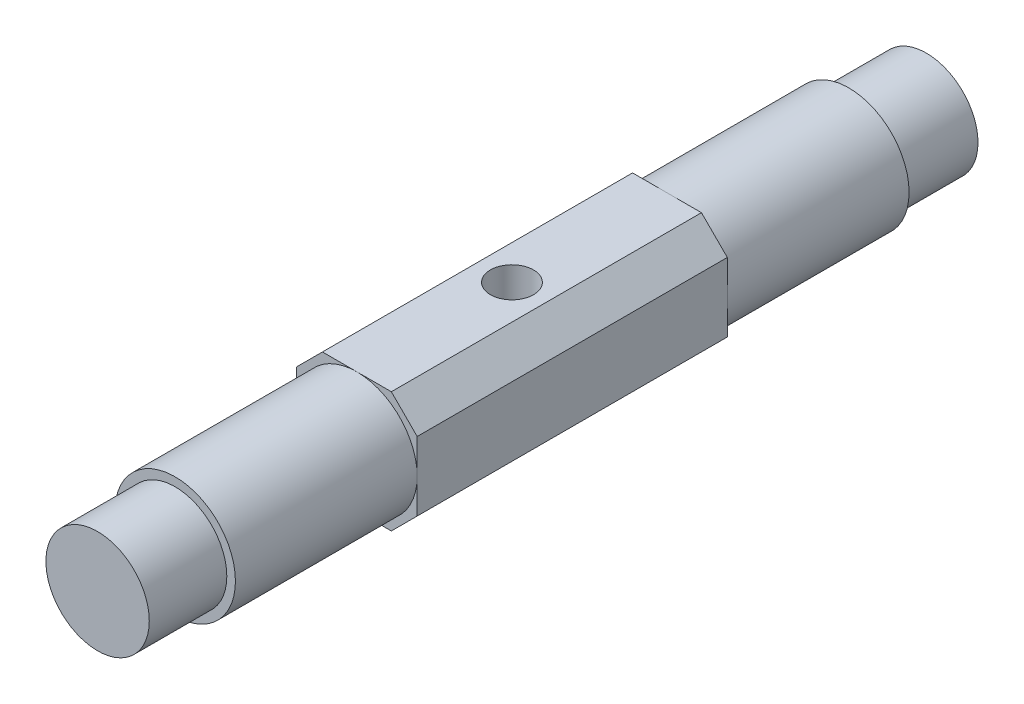
ISO-10303-21;
HEADER;
FILE_DESCRIPTION(('STEP AP214'),'2;1');
FILE_NAME('part.step','',(''),(''),'','','');
FILE_SCHEMA(('AUTOMOTIVE_DESIGN { 1 0 10303 214 1 1 1 1 }'));
ENDSEC;
DATA;
#1=APPLICATION_CONTEXT('core data for automotive mechanical design processes');
#2=APPLICATION_PROTOCOL_DEFINITION('international standard','automotive_design',2000,#1);
#3=PRODUCT_CONTEXT('',#1,'mechanical');
#4=PRODUCT('Part','Part','',(#3));
#5=PRODUCT_RELATED_PRODUCT_CATEGORY('part','',(#4));
#6=PRODUCT_DEFINITION_FORMATION('','',#4);
#7=PRODUCT_DEFINITION_CONTEXT('part definition',#1,'design');
#8=PRODUCT_DEFINITION('design','',#6,#7);
#9=PRODUCT_DEFINITION_SHAPE('','',#8);
#10=(LENGTH_UNIT() NAMED_UNIT(*) SI_UNIT(.MILLI.,.METRE.));
#11=(NAMED_UNIT(*) PLANE_ANGLE_UNIT() SI_UNIT($,.RADIAN.));
#12=(NAMED_UNIT(*) SI_UNIT($,.STERADIAN.) SOLID_ANGLE_UNIT());
#13=UNCERTAINTY_MEASURE_WITH_UNIT(LENGTH_MEASURE(1.E-05),#10,'distance_accuracy_value','');
#14=(GEOMETRIC_REPRESENTATION_CONTEXT(3) GLOBAL_UNCERTAINTY_ASSIGNED_CONTEXT((#13)) GLOBAL_UNIT_ASSIGNED_CONTEXT((#10,
#11,#12)) REPRESENTATION_CONTEXT('',''));
#15=CARTESIAN_POINT('',(0.,0.,0.));
#16=DIRECTION('',(0.,0.,1.));
#17=DIRECTION('',(1.,0.,0.));
#18=AXIS2_PLACEMENT_3D('',#15,#16,#17);
#19=CARTESIAN_POINT('',(0.,0.,33.05));
#20=DIRECTION('',(0.,0.,1.));
#21=DIRECTION('',(1.,0.,0.));
#22=AXIS2_PLACEMENT_3D('',#19,#20,#21);
#23=PLANE('',#22);
#24=DIRECTION('',(0.,1.,0.));
#25=VECTOR('',#24,1.);
#26=CARTESIAN_POINT('',(3.5,-3.5,33.05));
#27=LINE('',#26,#25);
#28=CARTESIAN_POINT('',(3.5,0.,33.05));
#29=VERTEX_POINT('',#28);
#30=CARTESIAN_POINT('',(3.5,1.99999999999999,33.05));
#31=VERTEX_POINT('',#30);
#32=EDGE_CURVE('E137',#29,#31,#27,.T.);
#33=ORIENTED_EDGE('',*,*,#32,.T.);
#34=DIRECTION('',(0.707106781186546,-0.707106781186549,0.));
#35=VECTOR('',#34,1.);
#36=CARTESIAN_POINT('',(2.75,2.74999999999999,33.05));
#37=LINE('',#36,#35);
#38=CARTESIAN_POINT('',(2.,3.5,33.05));
#39=VERTEX_POINT('',#38);
#40=EDGE_CURVE('E216',#31,#39,#37,.F.);
#41=ORIENTED_EDGE('',*,*,#40,.T.);
#42=DIRECTION('',(-1.,0.,0.));
#43=VECTOR('',#42,1.);
#44=CARTESIAN_POINT('',(3.5,3.5,33.05));
#45=LINE('',#44,#43);
#46=CARTESIAN_POINT('',(0.,3.5,33.05));
#47=VERTEX_POINT('',#46);
#48=EDGE_CURVE('E151',#39,#47,#45,.T.);
#49=ORIENTED_EDGE('',*,*,#48,.T.);
#50=CARTESIAN_POINT('',(0.,0.,33.05));
#51=DIRECTION('',(0.,0.,1.));
#52=DIRECTION('',(1.,0.,0.));
#53=AXIS2_PLACEMENT_3D('',#50,#51,#52);
#54=CIRCLE('',#53,3.5);
#55=EDGE_CURVE('E149',#29,#47,#54,.T.);
#56=ORIENTED_EDGE('',*,*,#55,.F.);
#57=EDGE_LOOP('',(#33,#41,#49,#56));
#58=FACE_BOUND('',#57,.T.);
#59=ADVANCED_FACE('F35',(#58),#23,.T.);
#60=CARTESIAN_POINT('',(-2.,3.5,33.05));
#61=VERTEX_POINT('',#60);
#62=EDGE_CURVE('E136',#47,#61,#45,.T.);
#63=ORIENTED_EDGE('',*,*,#62,.T.);
#64=DIRECTION('',(-0.707106781186549,-0.707106781186546,0.));
#65=VECTOR('',#64,1.);
#66=CARTESIAN_POINT('',(-2.74999999999999,2.75000000000001,33.05));
#67=LINE('',#66,#65);
#68=CARTESIAN_POINT('',(-3.5,2.,33.05));
#69=VERTEX_POINT('',#68);
#70=EDGE_CURVE('E11',#61,#69,#67,.T.);
#71=ORIENTED_EDGE('',*,*,#70,.T.);
#72=DIRECTION('',(0.,1.,0.));
#73=VECTOR('',#72,1.);
#74=CARTESIAN_POINT('',(-3.5,-3.5,33.05));
#75=LINE('',#74,#73);
#76=CARTESIAN_POINT('',(-3.5,0.,33.05));
#77=VERTEX_POINT('',#76);
#78=EDGE_CURVE('E171',#77,#69,#75,.T.);
#79=ORIENTED_EDGE('',*,*,#78,.F.);
#80=EDGE_CURVE('E158',#47,#77,#54,.T.);
#81=ORIENTED_EDGE('',*,*,#80,.F.);
#82=EDGE_LOOP('',(#63,#71,#79,#81));
#83=FACE_BOUND('',#82,.T.);
#84=ADVANCED_FACE('F241',(#83),#23,.T.);
#85=CARTESIAN_POINT('',(-3.5,-2.00000000000001,33.05));
#86=VERTEX_POINT('',#85);
#87=EDGE_CURVE('E172',#86,#77,#75,.T.);
#88=ORIENTED_EDGE('',*,*,#87,.F.);
#89=DIRECTION('',(-0.707106781186548,0.707106781186548,0.));
#90=VECTOR('',#89,1.);
#91=CARTESIAN_POINT('',(-2.75,-2.75,33.05));
#92=LINE('',#91,#90);
#93=CARTESIAN_POINT('',(-2.,-3.5,33.05));
#94=VERTEX_POINT('',#93);
#95=EDGE_CURVE('E224',#86,#94,#92,.F.);
#96=ORIENTED_EDGE('',*,*,#95,.T.);
#97=DIRECTION('',(-1.,0.,0.));
#98=VECTOR('',#97,1.);
#99=CARTESIAN_POINT('',(3.5,-3.5,33.05));
#100=LINE('',#99,#98);
#101=CARTESIAN_POINT('',(0.,-3.5,33.05));
#102=VERTEX_POINT('',#101);
#103=EDGE_CURVE('E174',#102,#94,#100,.T.);
#104=ORIENTED_EDGE('',*,*,#103,.F.);
#105=EDGE_CURVE('E162',#77,#102,#54,.T.);
#106=ORIENTED_EDGE('',*,*,#105,.F.);
#107=EDGE_LOOP('',(#88,#96,#104,#106));
#108=FACE_BOUND('',#107,.T.);
#109=ADVANCED_FACE('F266',(#108),#23,.T.);
#110=CARTESIAN_POINT('',(0.,0.,4.5));
#111=DIRECTION('',(0.,0.,-1.));
#112=DIRECTION('',(-1.,0.,0.));
#113=AXIS2_PLACEMENT_3D('',#110,#111,#112);
#114=CYLINDRICAL_SURFACE('',#113,3.);
#115=CARTESIAN_POINT('',(0.,0.,4.5));
#116=DIRECTION('',(0.,0.,1.));
#117=DIRECTION('',(1.,0.,0.));
#118=AXIS2_PLACEMENT_3D('',#115,#116,#117);
#119=CIRCLE('',#118,3.);
#120=CARTESIAN_POINT('',(3.,0.,4.5));
#121=VERTEX_POINT('',#120);
#122=EDGE_CURVE('E163',#121,#121,#119,.T.);
#123=ORIENTED_EDGE('',*,*,#122,.F.);
#124=EDGE_LOOP('',(#123));
#125=FACE_BOUND('',#124,.T.);
#126=CARTESIAN_POINT('',(0.,0.,0.));
#127=DIRECTION('',(0.,0.,1.));
#128=DIRECTION('',(1.,0.,0.));
#129=AXIS2_PLACEMENT_3D('',#126,#127,#128);
#130=CIRCLE('',#129,3.);
#131=CARTESIAN_POINT('',(3.,0.,0.));
#132=VERTEX_POINT('',#131);
#133=EDGE_CURVE('E165',#132,#132,#130,.T.);
#134=ORIENTED_EDGE('',*,*,#133,.T.);
#135=EDGE_LOOP('',(#134));
#136=FACE_BOUND('',#135,.T.);
#137=ADVANCED_FACE('F296',(#125,#136),#114,.T.);
#138=CARTESIAN_POINT('',(0.,0.,0.));
#139=DIRECTION('',(0.,0.,1.));
#140=DIRECTION('',(1.,0.,0.));
#141=AXIS2_PLACEMENT_3D('',#138,#139,#140);
#142=PLANE('',#141);
#143=ORIENTED_EDGE('',*,*,#133,.F.);
#144=EDGE_LOOP('',(#143));
#145=FACE_BOUND('',#144,.T.);
#146=ADVANCED_FACE('F292',(#145),#142,.F.);
#147=CARTESIAN_POINT('',(0.,0.,15.05));
#148=DIRECTION('',(0.,0.,-1.));
#149=DIRECTION('',(-1.,0.,0.));
#150=AXIS2_PLACEMENT_3D('',#147,#148,#149);
#151=CYLINDRICAL_SURFACE('',#150,3.5);
#152=CARTESIAN_POINT('',(0.,0.,15.05));
#153=DIRECTION('',(0.,0.,1.));
#154=DIRECTION('',(1.,0.,0.));
#155=AXIS2_PLACEMENT_3D('',#152,#153,#154);
#156=CIRCLE('',#155,3.5);
#157=CARTESIAN_POINT('',(3.5,0.,15.05));
#158=VERTEX_POINT('',#157);
#159=CARTESIAN_POINT('',(0.,3.5,15.05));
#160=VERTEX_POINT('',#159);
#161=EDGE_CURVE('E189',#158,#160,#156,.T.);
#162=ORIENTED_EDGE('',*,*,#161,.F.);
#163=CARTESIAN_POINT('',(0.,-3.5,15.05));
#164=VERTEX_POINT('',#163);
#165=EDGE_CURVE('E193',#164,#158,#156,.T.);
#166=ORIENTED_EDGE('',*,*,#165,.F.);
#167=CARTESIAN_POINT('',(-3.5,0.,15.05));
#168=VERTEX_POINT('',#167);
#169=EDGE_CURVE('E328',#168,#164,#156,.T.);
#170=ORIENTED_EDGE('',*,*,#169,.F.);
#171=EDGE_CURVE('E192',#160,#168,#156,.T.);
#172=ORIENTED_EDGE('',*,*,#171,.F.);
#173=EDGE_LOOP('',(#162,#166,#170,#172));
#174=FACE_BOUND('',#173,.T.);
#175=CARTESIAN_POINT('',(0.,0.,4.5));
#176=DIRECTION('',(0.,0.,1.));
#177=DIRECTION('',(1.,0.,0.));
#178=AXIS2_PLACEMENT_3D('',#175,#176,#177);
#179=CIRCLE('',#178,3.5);
#180=CARTESIAN_POINT('',(3.5,0.,4.5));
#181=VERTEX_POINT('',#180);
#182=EDGE_CURVE('E177',#181,#181,#179,.T.);
#183=ORIENTED_EDGE('',*,*,#182,.T.);
#184=EDGE_LOOP('',(#183));
#185=FACE_BOUND('',#184,.T.);
#186=ADVANCED_FACE('F288',(#174,#185),#151,.T.);
#187=CARTESIAN_POINT('',(0.,0.,4.5));
#188=DIRECTION('',(0.,0.,1.));
#189=DIRECTION('',(1.,0.,0.));
#190=AXIS2_PLACEMENT_3D('',#187,#188,#189);
#191=PLANE('',#190);
#192=ORIENTED_EDGE('',*,*,#122,.T.);
#193=EDGE_LOOP('',(#192));
#194=FACE_BOUND('',#193,.T.);
#195=ORIENTED_EDGE('',*,*,#182,.F.);
#196=EDGE_LOOP('',(#195));
#197=FACE_BOUND('',#196,.T.);
#198=ADVANCED_FACE('F274',(#194,#197),#191,.F.);
#199=CARTESIAN_POINT('',(0.,0.,15.05));
#200=DIRECTION('',(0.,0.,1.));
#201=DIRECTION('',(1.,0.,0.));
#202=AXIS2_PLACEMENT_3D('',#199,#200,#201);
#203=PLANE('',#202);
#204=DIRECTION('',(-1.,0.,0.));
#205=VECTOR('',#204,1.);
#206=CARTESIAN_POINT('',(3.5,3.5,15.05));
#207=LINE('',#206,#205);
#208=CARTESIAN_POINT('',(2.,3.5,15.05));
#209=VERTEX_POINT('',#208);
#210=EDGE_CURVE('E182',#209,#160,#207,.T.);
#211=ORIENTED_EDGE('',*,*,#210,.F.);
#212=DIRECTION('',(-0.707106781186546,0.707106781186549,0.));
#213=VECTOR('',#212,1.);
#214=CARTESIAN_POINT('',(2.,3.5,15.05));
#215=LINE('',#214,#213);
#216=CARTESIAN_POINT('',(3.5,1.99999999999999,15.05));
#217=VERTEX_POINT('',#216);
#218=EDGE_CURVE('E214',#209,#217,#215,.F.);
#219=ORIENTED_EDGE('',*,*,#218,.T.);
#220=DIRECTION('',(0.,1.,0.));
#221=VECTOR('',#220,1.);
#222=CARTESIAN_POINT('',(3.5,-3.5,15.05));
#223=LINE('',#222,#221);
#224=EDGE_CURVE('E181',#158,#217,#223,.T.);
#225=ORIENTED_EDGE('',*,*,#224,.F.);
#226=ORIENTED_EDGE('',*,*,#161,.T.);
#227=EDGE_LOOP('',(#211,#219,#225,#226));
#228=FACE_BOUND('',#227,.T.);
#229=ADVANCED_FACE('F247',(#228),#203,.F.);
#230=DIRECTION('',(0.,1.,0.));
#231=VECTOR('',#230,1.);
#232=CARTESIAN_POINT('',(-3.5,-3.5,15.05));
#233=LINE('',#232,#231);
#234=CARTESIAN_POINT('',(-3.5,2.,15.05));
#235=VERTEX_POINT('',#234);
#236=EDGE_CURVE('E184',#168,#235,#233,.T.);
#237=ORIENTED_EDGE('',*,*,#236,.T.);
#238=DIRECTION('',(0.707106781186549,0.707106781186546,0.));
#239=VECTOR('',#238,1.);
#240=CARTESIAN_POINT('',(-3.5,2.00000000000001,15.05));
#241=LINE('',#240,#239);
#242=CARTESIAN_POINT('',(-2.,3.5,15.05));
#243=VERTEX_POINT('',#242);
#244=EDGE_CURVE('E43',#235,#243,#241,.T.);
#245=ORIENTED_EDGE('',*,*,#244,.T.);
#246=EDGE_CURVE('E180',#160,#243,#207,.T.);
#247=ORIENTED_EDGE('',*,*,#246,.F.);
#248=ORIENTED_EDGE('',*,*,#171,.T.);
#249=EDGE_LOOP('',(#237,#245,#247,#248));
#250=FACE_BOUND('',#249,.T.);
#251=ADVANCED_FACE('F229',(#250),#203,.F.);
#252=DIRECTION('',(-1.,0.,0.));
#253=VECTOR('',#252,1.);
#254=CARTESIAN_POINT('',(3.5,-3.5,15.05));
#255=LINE('',#254,#253);
#256=CARTESIAN_POINT('',(-2.,-3.5,15.05));
#257=VERTEX_POINT('',#256);
#258=EDGE_CURVE('E187',#164,#257,#255,.T.);
#259=ORIENTED_EDGE('',*,*,#258,.T.);
#260=DIRECTION('',(0.707106781186548,-0.707106781186548,0.));
#261=VECTOR('',#260,1.);
#262=CARTESIAN_POINT('',(-2.,-3.5,15.05));
#263=LINE('',#262,#261);
#264=CARTESIAN_POINT('',(-3.5,-2.00000000000001,15.05));
#265=VERTEX_POINT('',#264);
#266=EDGE_CURVE('E218',#257,#265,#263,.F.);
#267=ORIENTED_EDGE('',*,*,#266,.T.);
#268=EDGE_CURVE('E185',#265,#168,#233,.T.);
#269=ORIENTED_EDGE('',*,*,#268,.T.);
#270=ORIENTED_EDGE('',*,*,#169,.T.);
#271=EDGE_LOOP('',(#259,#267,#269,#270));
#272=FACE_BOUND('',#271,.T.);
#273=ADVANCED_FACE('F333',(#272),#203,.F.);
#274=CARTESIAN_POINT('',(3.5,-2.,15.05));
#275=VERTEX_POINT('',#274);
#276=EDGE_CURVE('E178',#275,#158,#223,.T.);
#277=ORIENTED_EDGE('',*,*,#276,.F.);
#278=DIRECTION('',(-0.707106781186549,-0.707106781186546,0.));
#279=VECTOR('',#278,1.);
#280=CARTESIAN_POINT('',(3.5,-2.,15.05));
#281=LINE('',#280,#279);
#282=CARTESIAN_POINT('',(1.99999999999999,-3.5,15.05));
#283=VERTEX_POINT('',#282);
#284=EDGE_CURVE('E201',#275,#283,#281,.T.);
#285=ORIENTED_EDGE('',*,*,#284,.T.);
#286=EDGE_CURVE('E147',#283,#164,#255,.T.);
#287=ORIENTED_EDGE('',*,*,#286,.T.);
#288=ORIENTED_EDGE('',*,*,#165,.T.);
#289=EDGE_LOOP('',(#277,#285,#287,#288));
#290=FACE_BOUND('',#289,.T.);
#291=ADVANCED_FACE('F275',(#290),#203,.F.);
#292=CARTESIAN_POINT('',(3.5,-3.5,33.05));
#293=DIRECTION('',(-1.,0.,0.));
#294=DIRECTION('',(0.,0.,1.));
#295=AXIS2_PLACEMENT_3D('',#292,#293,#294);
#296=PLANE('',#295);
#297=CARTESIAN_POINT('',(3.5,-2.,33.05));
#298=VERTEX_POINT('',#297);
#299=EDGE_CURVE('E124',#298,#29,#27,.T.);
#300=ORIENTED_EDGE('',*,*,#299,.F.);
#301=DIRECTION('',(0.,0.,-1.));
#302=VECTOR('',#301,1.);
#303=CARTESIAN_POINT('',(3.5,-2.,15.05));
#304=LINE('',#303,#302);
#305=EDGE_CURVE('E199',#298,#275,#304,.T.);
#306=ORIENTED_EDGE('',*,*,#305,.T.);
#307=ORIENTED_EDGE('',*,*,#276,.T.);
#308=ORIENTED_EDGE('',*,*,#224,.T.);
#309=DIRECTION('',(0.,0.,1.));
#310=VECTOR('',#309,1.);
#311=CARTESIAN_POINT('',(3.5,1.99999999999999,33.05));
#312=LINE('',#311,#310);
#313=EDGE_CURVE('E144',#217,#31,#312,.T.);
#314=ORIENTED_EDGE('',*,*,#313,.T.);
#315=ORIENTED_EDGE('',*,*,#32,.F.);
#316=EDGE_LOOP('',(#300,#306,#307,#308,#314,#315));
#317=FACE_BOUND('',#316,.T.);
#318=ADVANCED_FACE('F141',(#317),#296,.F.);
#319=CARTESIAN_POINT('',(3.5,3.5,33.05));
#320=DIRECTION('',(0.,-1.,0.));
#321=DIRECTION('',(1.,0.,0.));
#322=AXIS2_PLACEMENT_3D('',#319,#320,#321);
#323=PLANE('',#322);
#324=CARTESIAN_POINT('',(0.,3.5,24.05));
#325=DIRECTION('',(0.,1.,0.));
#326=DIRECTION('',(-1.,0.,0.));
#327=AXIS2_PLACEMENT_3D('',#324,#325,#326);
#328=CIRCLE('',#327,1.25);
#329=CARTESIAN_POINT('',(-1.25,3.5,24.05));
#330=VERTEX_POINT('',#329);
#331=EDGE_CURVE('E426',#330,#330,#328,.T.);
#332=ORIENTED_EDGE('',*,*,#331,.F.);
#333=EDGE_LOOP('',(#332));
#334=FACE_BOUND('',#333,.T.);
#335=ORIENTED_EDGE('',*,*,#48,.F.);
#336=DIRECTION('',(0.,0.,-1.));
#337=VECTOR('',#336,1.);
#338=CARTESIAN_POINT('',(2.,3.5,33.05));
#339=LINE('',#338,#337);
#340=EDGE_CURVE('E211',#39,#209,#339,.T.);
#341=ORIENTED_EDGE('',*,*,#340,.T.);
#342=ORIENTED_EDGE('',*,*,#210,.T.);
#343=ORIENTED_EDGE('',*,*,#246,.T.);
#344=DIRECTION('',(0.,0.,1.));
#345=VECTOR('',#344,1.);
#346=CARTESIAN_POINT('',(-2.,3.5,33.05));
#347=LINE('',#346,#345);
#348=EDGE_CURVE('E209',#243,#61,#347,.T.);
#349=ORIENTED_EDGE('',*,*,#348,.T.);
#350=ORIENTED_EDGE('',*,*,#62,.F.);
#351=EDGE_LOOP('',(#335,#341,#342,#343,#349,#350));
#352=FACE_BOUND('',#351,.T.);
#353=ADVANCED_FACE('F233',(#334,#352),#323,.F.);
#354=CARTESIAN_POINT('',(-3.5,-3.5,33.05));
#355=DIRECTION('',(-1.,0.,0.));
#356=DIRECTION('',(0.,0.,1.));
#357=AXIS2_PLACEMENT_3D('',#354,#355,#356);
#358=PLANE('',#357);
#359=ORIENTED_EDGE('',*,*,#268,.F.);
#360=DIRECTION('',(0.,0.,1.));
#361=VECTOR('',#360,1.);
#362=CARTESIAN_POINT('',(-3.5,-2.00000000000001,33.05));
#363=LINE('',#362,#361);
#364=EDGE_CURVE('E222',#265,#86,#363,.T.);
#365=ORIENTED_EDGE('',*,*,#364,.T.);
#366=ORIENTED_EDGE('',*,*,#87,.T.);
#367=ORIENTED_EDGE('',*,*,#78,.T.);
#368=DIRECTION('',(0.,0.,-1.));
#369=VECTOR('',#368,1.);
#370=CARTESIAN_POINT('',(-3.5,2.00000000000001,15.05));
#371=LINE('',#370,#369);
#372=EDGE_CURVE('E220',#69,#235,#371,.T.);
#373=ORIENTED_EDGE('',*,*,#372,.T.);
#374=ORIENTED_EDGE('',*,*,#236,.F.);
#375=EDGE_LOOP('',(#359,#365,#366,#367,#373,#374));
#376=FACE_BOUND('',#375,.T.);
#377=ADVANCED_FACE('F239',(#376),#358,.T.);
#378=CARTESIAN_POINT('',(3.5,-3.5,33.05));
#379=DIRECTION('',(0.,-1.,0.));
#380=DIRECTION('',(1.,0.,0.));
#381=AXIS2_PLACEMENT_3D('',#378,#379,#380);
#382=PLANE('',#381);
#383=CARTESIAN_POINT('',(0.,-3.5,24.05));
#384=DIRECTION('',(0.,1.,0.));
#385=DIRECTION('',(-1.,0.,0.));
#386=AXIS2_PLACEMENT_3D('',#383,#384,#385);
#387=CIRCLE('',#386,1.25);
#388=CARTESIAN_POINT('',(-1.25,-3.5,24.05));
#389=VERTEX_POINT('',#388);
#390=EDGE_CURVE('E423',#389,#389,#387,.T.);
#391=ORIENTED_EDGE('',*,*,#390,.T.);
#392=EDGE_LOOP('',(#391));
#393=FACE_BOUND('',#392,.T.);
#394=ORIENTED_EDGE('',*,*,#286,.F.);
#395=DIRECTION('',(0.,0.,1.));
#396=VECTOR('',#395,1.);
#397=CARTESIAN_POINT('',(1.99999999999999,-3.5,33.05));
#398=LINE('',#397,#396);
#399=CARTESIAN_POINT('',(1.99999999999999,-3.5,33.05));
#400=VERTEX_POINT('',#399);
#401=EDGE_CURVE('E206',#283,#400,#398,.T.);
#402=ORIENTED_EDGE('',*,*,#401,.T.);
#403=EDGE_CURVE('E175',#400,#102,#100,.T.);
#404=ORIENTED_EDGE('',*,*,#403,.T.);
#405=ORIENTED_EDGE('',*,*,#103,.T.);
#406=DIRECTION('',(0.,0.,-1.));
#407=VECTOR('',#406,1.);
#408=CARTESIAN_POINT('',(-2.,-3.5,33.05));
#409=LINE('',#408,#407);
#410=EDGE_CURVE('E203',#94,#257,#409,.T.);
#411=ORIENTED_EDGE('',*,*,#410,.T.);
#412=ORIENTED_EDGE('',*,*,#258,.F.);
#413=EDGE_LOOP('',(#394,#402,#404,#405,#411,#412));
#414=FACE_BOUND('',#413,.T.);
#415=ADVANCED_FACE('F264',(#393,#414),#382,.T.);
#416=ORIENTED_EDGE('',*,*,#403,.F.);
#417=DIRECTION('',(0.707106781186549,0.707106781186546,0.));
#418=VECTOR('',#417,1.);
#419=CARTESIAN_POINT('',(2.74999999999999,-2.75,33.05));
#420=LINE('',#419,#418);
#421=EDGE_CURVE('E132',#400,#298,#420,.T.);
#422=ORIENTED_EDGE('',*,*,#421,.T.);
#423=ORIENTED_EDGE('',*,*,#299,.T.);
#424=EDGE_CURVE('E129',#102,#29,#54,.T.);
#425=ORIENTED_EDGE('',*,*,#424,.F.);
#426=EDGE_LOOP('',(#416,#422,#423,#425));
#427=FACE_BOUND('',#426,.T.);
#428=ADVANCED_FACE('F127',(#427),#23,.T.);
#429=CARTESIAN_POINT('',(0.,0.,43.6));
#430=DIRECTION('',(0.,0.,-1.));
#431=DIRECTION('',(-1.,0.,0.));
#432=AXIS2_PLACEMENT_3D('',#429,#430,#431);
#433=CYLINDRICAL_SURFACE('',#432,3.5);
#434=CARTESIAN_POINT('',(0.,0.,43.6));
#435=DIRECTION('',(0.,0.,1.));
#436=DIRECTION('',(1.,0.,0.));
#437=AXIS2_PLACEMENT_3D('',#434,#435,#436);
#438=CIRCLE('',#437,3.5);
#439=CARTESIAN_POINT('',(3.5,0.,43.6));
#440=VERTEX_POINT('',#439);
#441=EDGE_CURVE('E155',#440,#440,#438,.T.);
#442=ORIENTED_EDGE('',*,*,#441,.F.);
#443=EDGE_LOOP('',(#442));
#444=FACE_BOUND('',#443,.T.);
#445=ORIENTED_EDGE('',*,*,#55,.T.);
#446=ORIENTED_EDGE('',*,*,#80,.T.);
#447=ORIENTED_EDGE('',*,*,#105,.T.);
#448=ORIENTED_EDGE('',*,*,#424,.T.);
#449=EDGE_LOOP('',(#445,#446,#447,#448));
#450=FACE_BOUND('',#449,.T.);
#451=ADVANCED_FACE('F160',(#444,#450),#433,.T.);
#452=CARTESIAN_POINT('',(0.,0.,43.6));
#453=DIRECTION('',(0.,0.,1.));
#454=DIRECTION('',(1.,0.,0.));
#455=AXIS2_PLACEMENT_3D('',#452,#453,#454);
#456=PLANE('',#455);
#457=CARTESIAN_POINT('',(0.,0.,43.6));
#458=DIRECTION('',(0.,0.,1.));
#459=DIRECTION('',(1.,0.,0.));
#460=AXIS2_PLACEMENT_3D('',#457,#458,#459);
#461=CIRCLE('',#460,3.);
#462=CARTESIAN_POINT('',(3.,0.,43.6));
#463=VERTEX_POINT('',#462);
#464=EDGE_CURVE('E422',#463,#463,#461,.T.);
#465=ORIENTED_EDGE('',*,*,#464,.F.);
#466=EDGE_LOOP('',(#465));
#467=FACE_BOUND('',#466,.T.);
#468=ORIENTED_EDGE('',*,*,#441,.T.);
#469=EDGE_LOOP('',(#468));
#470=FACE_BOUND('',#469,.T.);
#471=ADVANCED_FACE('F253',(#467,#470),#456,.T.);
#472=CARTESIAN_POINT('',(0.,0.,48.1));
#473=DIRECTION('',(0.,0.,-1.));
#474=DIRECTION('',(-1.,0.,0.));
#475=AXIS2_PLACEMENT_3D('',#472,#473,#474);
#476=CYLINDRICAL_SURFACE('',#475,3.);
#477=CARTESIAN_POINT('',(0.,0.,48.1));
#478=DIRECTION('',(0.,0.,1.));
#479=DIRECTION('',(1.,0.,0.));
#480=AXIS2_PLACEMENT_3D('',#477,#478,#479);
#481=CIRCLE('',#480,3.);
#482=CARTESIAN_POINT('',(3.,0.,48.1));
#483=VERTEX_POINT('',#482);
#484=EDGE_CURVE('E156',#483,#483,#481,.T.);
#485=ORIENTED_EDGE('',*,*,#484,.F.);
#486=EDGE_LOOP('',(#485));
#487=FACE_BOUND('',#486,.T.);
#488=ORIENTED_EDGE('',*,*,#464,.T.);
#489=EDGE_LOOP('',(#488));
#490=FACE_BOUND('',#489,.T.);
#491=ADVANCED_FACE('F261',(#487,#490),#476,.T.);
#492=CARTESIAN_POINT('',(0.,0.,48.1));
#493=DIRECTION('',(0.,0.,1.));
#494=DIRECTION('',(1.,0.,0.));
#495=AXIS2_PLACEMENT_3D('',#492,#493,#494);
#496=PLANE('',#495);
#497=ORIENTED_EDGE('',*,*,#484,.T.);
#498=EDGE_LOOP('',(#497));
#499=FACE_BOUND('',#498,.T.);
#500=ADVANCED_FACE('F384',(#499),#496,.T.);
#501=CARTESIAN_POINT('',(0.,-3.5,24.05));
#502=DIRECTION('',(0.,1.,0.));
#503=DIRECTION('',(-1.,0.,0.));
#504=AXIS2_PLACEMENT_3D('',#501,#502,#503);
#505=CYLINDRICAL_SURFACE('',#504,1.25);
#506=ORIENTED_EDGE('',*,*,#390,.F.);
#507=EDGE_LOOP('',(#506));
#508=FACE_BOUND('',#507,.T.);
#509=ORIENTED_EDGE('',*,*,#331,.T.);
#510=EDGE_LOOP('',(#509));
#511=FACE_BOUND('',#510,.T.);
#512=ADVANCED_FACE('F304',(#508,#511),#505,.F.);
#513=CARTESIAN_POINT('',(3.5,-2.,33.05));
#514=DIRECTION('',(0.707106781186546,-0.707106781186549,0.));
#515=DIRECTION('',(0.,0.,1.));
#516=AXIS2_PLACEMENT_3D('',#513,#514,#515);
#517=PLANE('',#516);
#518=ORIENTED_EDGE('',*,*,#421,.F.);
#519=ORIENTED_EDGE('',*,*,#401,.F.);
#520=ORIENTED_EDGE('',*,*,#284,.F.);
#521=ORIENTED_EDGE('',*,*,#305,.F.);
#522=EDGE_LOOP('',(#518,#519,#520,#521));
#523=FACE_BOUND('',#522,.T.);
#524=ADVANCED_FACE('F301',(#523),#517,.T.);
#525=CARTESIAN_POINT('',(2.,3.5,33.05));
#526=DIRECTION('',(-0.707106781186549,-0.707106781186546,0.));
#527=DIRECTION('',(0.,0.,-1.));
#528=AXIS2_PLACEMENT_3D('',#525,#526,#527);
#529=PLANE('',#528);
#530=ORIENTED_EDGE('',*,*,#40,.F.);
#531=ORIENTED_EDGE('',*,*,#313,.F.);
#532=ORIENTED_EDGE('',*,*,#218,.F.);
#533=ORIENTED_EDGE('',*,*,#340,.F.);
#534=EDGE_LOOP('',(#530,#531,#532,#533));
#535=FACE_BOUND('',#534,.T.);
#536=ADVANCED_FACE('F244',(#535),#529,.F.);
#537=CARTESIAN_POINT('',(-2.,-3.5,33.05));
#538=DIRECTION('',(0.707106781186548,0.707106781186548,0.));
#539=DIRECTION('',(0.,0.,-1.));
#540=AXIS2_PLACEMENT_3D('',#537,#538,#539);
#541=PLANE('',#540);
#542=ORIENTED_EDGE('',*,*,#95,.F.);
#543=ORIENTED_EDGE('',*,*,#364,.F.);
#544=ORIENTED_EDGE('',*,*,#266,.F.);
#545=ORIENTED_EDGE('',*,*,#410,.F.);
#546=EDGE_LOOP('',(#542,#543,#544,#545));
#547=FACE_BOUND('',#546,.T.);
#548=ADVANCED_FACE('F307',(#547),#541,.F.);
#549=CARTESIAN_POINT('',(-3.5,2.00000000000001,33.05));
#550=DIRECTION('',(-0.707106781186546,0.707106781186549,0.));
#551=DIRECTION('',(0.,0.,1.));
#552=AXIS2_PLACEMENT_3D('',#549,#550,#551);
#553=PLANE('',#552);
#554=ORIENTED_EDGE('',*,*,#70,.F.);
#555=ORIENTED_EDGE('',*,*,#348,.F.);
#556=ORIENTED_EDGE('',*,*,#244,.F.);
#557=ORIENTED_EDGE('',*,*,#372,.F.);
#558=EDGE_LOOP('',(#554,#555,#556,#557));
#559=FACE_BOUND('',#558,.T.);
#560=ADVANCED_FACE('F37',(#559),#553,.T.);
#561=CLOSED_SHELL('',(#59,#84,#109,#137,#146,#186,#198,#229,#251,#273,#291,#318,#353,#377,#415,
#428,#451,#471,#491,#500,#512,#524,#536,#548,#560));
#562=MANIFOLD_SOLID_BREP('B2',#561);
#563=ADVANCED_BREP_SHAPE_REPRESENTATION('',(#18,#562),#14);
#564=SHAPE_DEFINITION_REPRESENTATION(#9,#563);
ENDSEC;
END-ISO-10303-21;
